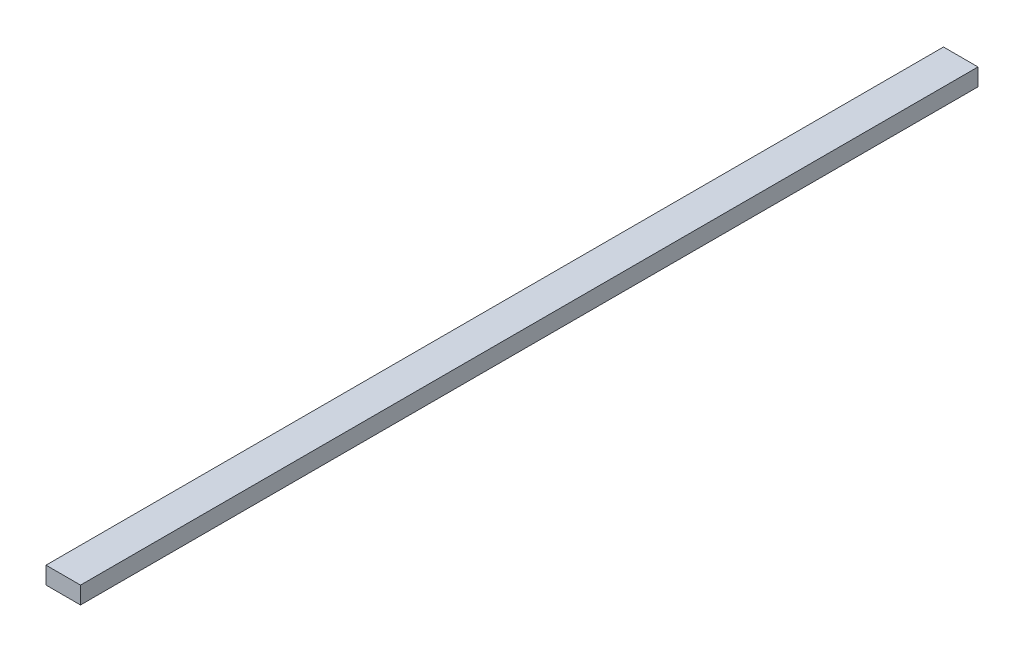
ISO-10303-21;
HEADER;
FILE_DESCRIPTION(('STEP AP214'),'2;1');
FILE_NAME('part.step','',(''),(''),'','','');
FILE_SCHEMA(('AUTOMOTIVE_DESIGN { 1 0 10303 214 1 1 1 1 }'));
ENDSEC;
DATA;
#1=APPLICATION_CONTEXT('core data for automotive mechanical design processes');
#2=APPLICATION_PROTOCOL_DEFINITION('international standard','automotive_design',2000,#1);
#3=PRODUCT_CONTEXT('',#1,'mechanical');
#4=PRODUCT('Part','Part','',(#3));
#5=PRODUCT_RELATED_PRODUCT_CATEGORY('part','',(#4));
#6=PRODUCT_DEFINITION_FORMATION('','',#4);
#7=PRODUCT_DEFINITION_CONTEXT('part definition',#1,'design');
#8=PRODUCT_DEFINITION('design','',#6,#7);
#9=PRODUCT_DEFINITION_SHAPE('','',#8);
#10=(LENGTH_UNIT() NAMED_UNIT(*) SI_UNIT(.MILLI.,.METRE.));
#11=(NAMED_UNIT(*) PLANE_ANGLE_UNIT() SI_UNIT($,.RADIAN.));
#12=(NAMED_UNIT(*) SI_UNIT($,.STERADIAN.) SOLID_ANGLE_UNIT());
#13=UNCERTAINTY_MEASURE_WITH_UNIT(LENGTH_MEASURE(1.E-05),#10,'distance_accuracy_value','');
#14=(GEOMETRIC_REPRESENTATION_CONTEXT(3) GLOBAL_UNCERTAINTY_ASSIGNED_CONTEXT((#13)) GLOBAL_UNIT_ASSIGNED_CONTEXT((#10,
#11,#12)) REPRESENTATION_CONTEXT('',''));
#15=CARTESIAN_POINT('',(0.,0.,0.));
#16=DIRECTION('',(0.,0.,1.));
#17=DIRECTION('',(1.,0.,0.));
#18=AXIS2_PLACEMENT_3D('',#15,#16,#17);
#19=CARTESIAN_POINT('',(-23.9097744360902,22.6315789473684,2080.));
#20=DIRECTION('',(1.,0.,0.));
#21=DIRECTION('',(0.,0.,-1.));
#22=AXIS2_PLACEMENT_3D('',#19,#20,#21);
#23=PLANE('',#22);
#24=DIRECTION('',(0.,-1.,0.));
#25=VECTOR('',#24,1.);
#26=CARTESIAN_POINT('',(-23.9097744360902,22.6315789473684,0.));
#27=LINE('',#26,#25);
#28=CARTESIAN_POINT('',(-23.9097744360902,22.6315789473684,0.));
#29=VERTEX_POINT('',#28);
#30=CARTESIAN_POINT('',(-23.9097744360902,-17.3684210526316,0.));
#31=VERTEX_POINT('',#30);
#32=EDGE_CURVE('E95',#29,#31,#27,.T.);
#33=ORIENTED_EDGE('',*,*,#32,.T.);
#34=DIRECTION('',(0.,0.,-1.));
#35=VECTOR('',#34,1.);
#36=CARTESIAN_POINT('',(-23.9097744360902,-17.3684210526316,2080.));
#37=LINE('',#36,#35);
#38=CARTESIAN_POINT('',(-23.9097744360902,-17.3684210526316,2080.));
#39=VERTEX_POINT('',#38);
#40=EDGE_CURVE('E11',#39,#31,#37,.T.);
#41=ORIENTED_EDGE('',*,*,#40,.F.);
#42=DIRECTION('',(0.,-1.,0.));
#43=VECTOR('',#42,1.);
#44=CARTESIAN_POINT('',(-23.9097744360902,22.6315789473684,2080.));
#45=LINE('',#44,#43);
#46=CARTESIAN_POINT('',(-23.9097744360902,22.6315789473684,2080.));
#47=VERTEX_POINT('',#46);
#48=EDGE_CURVE('E83',#47,#39,#45,.T.);
#49=ORIENTED_EDGE('',*,*,#48,.F.);
#50=DIRECTION('',(0.,0.,-1.));
#51=VECTOR('',#50,1.);
#52=CARTESIAN_POINT('',(-23.9097744360902,22.6315789473684,2080.));
#53=LINE('',#52,#51);
#54=EDGE_CURVE('E91',#47,#29,#53,.T.);
#55=ORIENTED_EDGE('',*,*,#54,.T.);
#56=EDGE_LOOP('',(#33,#41,#49,#55));
#57=FACE_BOUND('',#56,.T.);
#58=ADVANCED_FACE('F32',(#57),#23,.F.);
#59=CARTESIAN_POINT('',(-23.9097744360902,-17.3684210526316,2080.));
#60=DIRECTION('',(0.,1.,0.));
#61=DIRECTION('',(0.,0.,1.));
#62=AXIS2_PLACEMENT_3D('',#59,#60,#61);
#63=PLANE('',#62);
#64=DIRECTION('',(1.,0.,0.));
#65=VECTOR('',#64,1.);
#66=CARTESIAN_POINT('',(-23.9097744360902,-17.3684210526316,0.));
#67=LINE('',#66,#65);
#68=CARTESIAN_POINT('',(56.0902255639098,-17.3684210526316,0.));
#69=VERTEX_POINT('',#68);
#70=EDGE_CURVE('E87',#31,#69,#67,.T.);
#71=ORIENTED_EDGE('',*,*,#70,.T.);
#72=DIRECTION('',(0.,0.,-1.));
#73=VECTOR('',#72,1.);
#74=CARTESIAN_POINT('',(56.0902255639098,-17.3684210526316,2080.));
#75=LINE('',#74,#73);
#76=CARTESIAN_POINT('',(56.0902255639098,-17.3684210526316,2080.));
#77=VERTEX_POINT('',#76);
#78=EDGE_CURVE('E40',#77,#69,#75,.T.);
#79=ORIENTED_EDGE('',*,*,#78,.F.);
#80=DIRECTION('',(1.,0.,0.));
#81=VECTOR('',#80,1.);
#82=CARTESIAN_POINT('',(-23.9097744360902,-17.3684210526316,2080.));
#83=LINE('',#82,#81);
#84=EDGE_CURVE('E78',#39,#77,#83,.T.);
#85=ORIENTED_EDGE('',*,*,#84,.F.);
#86=ORIENTED_EDGE('',*,*,#40,.T.);
#87=EDGE_LOOP('',(#71,#79,#85,#86));
#88=FACE_BOUND('',#87,.T.);
#89=ADVANCED_FACE('F86',(#88),#63,.F.);
#90=CARTESIAN_POINT('',(56.0902255639098,22.6315789473684,2080.));
#91=DIRECTION('',(-1.,0.,0.));
#92=DIRECTION('',(0.,0.,1.));
#93=AXIS2_PLACEMENT_3D('',#90,#91,#92);
#94=PLANE('',#93);
#95=DIRECTION('',(0.,1.,0.));
#96=VECTOR('',#95,1.);
#97=CARTESIAN_POINT('',(56.0902255639098,22.6315789473684,0.));
#98=LINE('',#97,#96);
#99=CARTESIAN_POINT('',(56.0902255639098,22.6315789473684,0.));
#100=VERTEX_POINT('',#99);
#101=EDGE_CURVE('E65',#69,#100,#98,.T.);
#102=ORIENTED_EDGE('',*,*,#101,.T.);
#103=DIRECTION('',(0.,0.,-1.));
#104=VECTOR('',#103,1.);
#105=CARTESIAN_POINT('',(56.0902255639098,22.6315789473684,2080.));
#106=LINE('',#105,#104);
#107=CARTESIAN_POINT('',(56.0902255639098,22.6315789473684,2080.));
#108=VERTEX_POINT('',#107);
#109=EDGE_CURVE('E88',#108,#100,#106,.T.);
#110=ORIENTED_EDGE('',*,*,#109,.F.);
#111=DIRECTION('',(0.,1.,0.));
#112=VECTOR('',#111,1.);
#113=CARTESIAN_POINT('',(56.0902255639098,22.6315789473684,2080.));
#114=LINE('',#113,#112);
#115=EDGE_CURVE('E81',#77,#108,#114,.T.);
#116=ORIENTED_EDGE('',*,*,#115,.F.);
#117=ORIENTED_EDGE('',*,*,#78,.T.);
#118=EDGE_LOOP('',(#102,#110,#116,#117));
#119=FACE_BOUND('',#118,.T.);
#120=ADVANCED_FACE('F89',(#119),#94,.F.);
#121=CARTESIAN_POINT('',(-23.9097744360902,22.6315789473684,2080.));
#122=DIRECTION('',(0.,-1.,0.));
#123=DIRECTION('',(0.,0.,-1.));
#124=AXIS2_PLACEMENT_3D('',#121,#122,#123);
#125=PLANE('',#124);
#126=DIRECTION('',(-1.,0.,0.));
#127=VECTOR('',#126,1.);
#128=CARTESIAN_POINT('',(-23.9097744360902,22.6315789473684,0.));
#129=LINE('',#128,#127);
#130=EDGE_CURVE('E71',#100,#29,#129,.T.);
#131=ORIENTED_EDGE('',*,*,#130,.T.);
#132=ORIENTED_EDGE('',*,*,#54,.F.);
#133=DIRECTION('',(-1.,0.,0.));
#134=VECTOR('',#133,1.);
#135=CARTESIAN_POINT('',(-23.9097744360902,22.6315789473684,2080.));
#136=LINE('',#135,#134);
#137=EDGE_CURVE('E48',#108,#47,#136,.T.);
#138=ORIENTED_EDGE('',*,*,#137,.F.);
#139=ORIENTED_EDGE('',*,*,#109,.T.);
#140=EDGE_LOOP('',(#131,#132,#138,#139));
#141=FACE_BOUND('',#140,.T.);
#142=ADVANCED_FACE('F102',(#141),#125,.F.);
#143=CARTESIAN_POINT('',(0.,0.,2080.));
#144=DIRECTION('',(0.,0.,1.));
#145=DIRECTION('',(1.,0.,0.));
#146=AXIS2_PLACEMENT_3D('',#143,#144,#145);
#147=PLANE('',#146);
#148=ORIENTED_EDGE('',*,*,#48,.T.);
#149=ORIENTED_EDGE('',*,*,#84,.T.);
#150=ORIENTED_EDGE('',*,*,#115,.T.);
#151=ORIENTED_EDGE('',*,*,#137,.T.);
#152=EDGE_LOOP('',(#148,#149,#150,#151));
#153=FACE_BOUND('',#152,.T.);
#154=ADVANCED_FACE('F79',(#153),#147,.T.);
#155=CARTESIAN_POINT('',(0.,0.,0.));
#156=DIRECTION('',(0.,0.,1.));
#157=DIRECTION('',(1.,0.,0.));
#158=AXIS2_PLACEMENT_3D('',#155,#156,#157);
#159=PLANE('',#158);
#160=ORIENTED_EDGE('',*,*,#32,.F.);
#161=ORIENTED_EDGE('',*,*,#130,.F.);
#162=ORIENTED_EDGE('',*,*,#101,.F.);
#163=ORIENTED_EDGE('',*,*,#70,.F.);
#164=EDGE_LOOP('',(#160,#161,#162,#163));
#165=FACE_BOUND('',#164,.T.);
#166=ADVANCED_FACE('F105',(#165),#159,.F.);
#167=CLOSED_SHELL('',(#58,#89,#120,#142,#154,#166));
#168=MANIFOLD_SOLID_BREP('B2',#167);
#169=ADVANCED_BREP_SHAPE_REPRESENTATION('',(#18,#168),#14);
#170=SHAPE_DEFINITION_REPRESENTATION(#9,#169);
ENDSEC;
END-ISO-10303-21;
